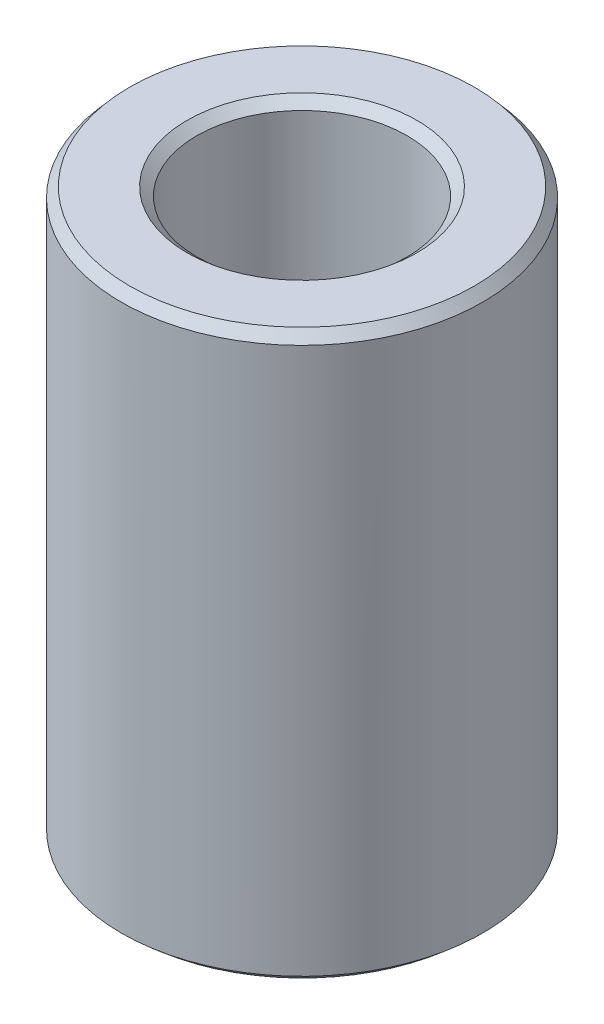
ISO-10303-21;
HEADER;
FILE_DESCRIPTION(('STEP AP214'),'2;1');
FILE_NAME('part.step','',(''),(''),'','','');
FILE_SCHEMA(('AUTOMOTIVE_DESIGN { 1 0 10303 214 1 1 1 1 }'));
ENDSEC;
DATA;
#1=APPLICATION_CONTEXT('core data for automotive mechanical design processes');
#2=APPLICATION_PROTOCOL_DEFINITION('international standard','automotive_design',2000,#1);
#3=PRODUCT_CONTEXT('',#1,'mechanical');
#4=PRODUCT('Part','Part','',(#3));
#5=PRODUCT_RELATED_PRODUCT_CATEGORY('part','',(#4));
#6=PRODUCT_DEFINITION_FORMATION('','',#4);
#7=PRODUCT_DEFINITION_CONTEXT('part definition',#1,'design');
#8=PRODUCT_DEFINITION('design','',#6,#7);
#9=PRODUCT_DEFINITION_SHAPE('','',#8);
#10=(LENGTH_UNIT() NAMED_UNIT(*) SI_UNIT(.MILLI.,.METRE.));
#11=(NAMED_UNIT(*) PLANE_ANGLE_UNIT() SI_UNIT($,.RADIAN.));
#12=(NAMED_UNIT(*) SI_UNIT($,.STERADIAN.) SOLID_ANGLE_UNIT());
#13=UNCERTAINTY_MEASURE_WITH_UNIT(LENGTH_MEASURE(1.E-05),#10,'distance_accuracy_value','');
#14=(GEOMETRIC_REPRESENTATION_CONTEXT(3) GLOBAL_UNCERTAINTY_ASSIGNED_CONTEXT((#13)) GLOBAL_UNIT_ASSIGNED_CONTEXT((#10,
#11,#12)) REPRESENTATION_CONTEXT('',''));
#15=CARTESIAN_POINT('',(0.,0.,0.));
#16=DIRECTION('',(0.,0.,1.));
#17=DIRECTION('',(1.,0.,0.));
#18=AXIS2_PLACEMENT_3D('',#15,#16,#17);
#19=CARTESIAN_POINT('',(0.,46.8625927404749,0.));
#20=DIRECTION('',(0.,-1.,0.));
#21=DIRECTION('',(0.,0.,-1.));
#22=AXIS2_PLACEMENT_3D('',#19,#20,#21);
#23=CYLINDRICAL_SURFACE('',#22,15.);
#24=CARTESIAN_POINT('',(0.,0.698088611148291,0.));
#25=DIRECTION('',(0.,1.,0.));
#26=DIRECTION('',(0.,0.,1.));
#27=AXIS2_PLACEMENT_3D('',#24,#25,#26);
#28=CIRCLE('',#27,15.);
#29=CARTESIAN_POINT('',(0.,0.698088611148284,-15.));
#30=VERTEX_POINT('',#29);
#31=EDGE_CURVE('E10',#30,#30,#28,.T.);
#32=CARTESIAN_POINT('',(0.,46.0512297365467,0.));
#33=DIRECTION('',(0.,1.,0.));
#34=DIRECTION('',(0.,0.,1.));
#35=AXIS2_PLACEMENT_3D('',#32,#33,#34);
#36=CIRCLE('',#35,15.);
#37=CARTESIAN_POINT('',(0.,46.0512297365467,-15.));
#38=VERTEX_POINT('',#37);
#39=EDGE_CURVE('E50',#38,#38,#36,.F.);
#40=CARTESIAN_POINT('',(0.,0.698088611148284,-15.));
#41=CARTESIAN_POINT('',(0.,1.17051716453785,-15.));
#42=CARTESIAN_POINT('',(0.,1.64294571792742,-15.));
#43=CARTESIAN_POINT('',(0.,2.58780282470655,-15.));
#44=CARTESIAN_POINT('',(0.,3.06023137809612,-15.));
#45=CARTESIAN_POINT('',(0.,4.00508848487525,-15.));
#46=CARTESIAN_POINT('',(0.,4.47751703826482,-15.));
#47=CARTESIAN_POINT('',(0.,5.42237414504395,-15.));
#48=CARTESIAN_POINT('',(0.,5.89480269843352,-15.));
#49=CARTESIAN_POINT('',(0.,6.83965980521265,-15.));
#50=CARTESIAN_POINT('',(0.,7.31208835860222,-15.));
#51=CARTESIAN_POINT('',(0.,8.25694546538135,-15.));
#52=CARTESIAN_POINT('',(0.,8.72937401877092,-15.));
#53=CARTESIAN_POINT('',(0.,9.67423112555005,-15.));
#54=CARTESIAN_POINT('',(0.,10.1466596789396,-15.));
#55=CARTESIAN_POINT('',(0.,11.0915167857187,-15.));
#56=CARTESIAN_POINT('',(0.,11.5639453391083,-15.));
#57=CARTESIAN_POINT('',(0.,12.5088024458875,-15.));
#58=CARTESIAN_POINT('',(0.,12.981230999277,-15.));
#59=CARTESIAN_POINT('',(0.,13.9260881060562,-15.));
#60=CARTESIAN_POINT('',(0.,14.3985166594457,-15.));
#61=CARTESIAN_POINT('',(0.,15.3433737662249,-15.));
#62=CARTESIAN_POINT('',(0.,15.8158023196144,-15.));
#63=CARTESIAN_POINT('',(0.,16.7606594263935,-15.));
#64=CARTESIAN_POINT('',(0.,17.2330879797831,-15.));
#65=CARTESIAN_POINT('',(0.,18.1779450865622,-15.));
#66=CARTESIAN_POINT('',(0.,18.6503736399518,-15.));
#67=CARTESIAN_POINT('',(0.,19.5952307467309,-15.));
#68=CARTESIAN_POINT('',(0.,20.0676593001205,-15.));
#69=CARTESIAN_POINT('',(0.,21.0125164068996,-15.));
#70=CARTESIAN_POINT('',(0.,21.4849449602892,-15.));
#71=CARTESIAN_POINT('',(0.,22.4298020670683,-15.));
#72=CARTESIAN_POINT('',(0.,22.9022306204579,-15.));
#73=CARTESIAN_POINT('',(0.,23.847087727237,-15.));
#74=CARTESIAN_POINT('',(0.,24.3195162806266,-15.));
#75=CARTESIAN_POINT('',(0.,25.2643733874058,-15.));
#76=CARTESIAN_POINT('',(0.,25.7368019407953,-15.));
#77=CARTESIAN_POINT('',(0.,26.6816590475744,-15.));
#78=CARTESIAN_POINT('',(0.,27.154087600964,-15.));
#79=CARTESIAN_POINT('',(0.,28.0989447077431,-15.));
#80=CARTESIAN_POINT('',(0.,28.5713732611327,-15.));
#81=CARTESIAN_POINT('',(0.,29.5162303679118,-15.));
#82=CARTESIAN_POINT('',(0.,29.9886589213014,-15.));
#83=CARTESIAN_POINT('',(0.,30.9335160280806,-15.));
#84=CARTESIAN_POINT('',(0.,31.4059445814701,-15.));
#85=CARTESIAN_POINT('',(0.,32.3508016882492,-15.));
#86=CARTESIAN_POINT('',(0.,32.8232302416388,-15.));
#87=CARTESIAN_POINT('',(0.,33.7680873484179,-15.));
#88=CARTESIAN_POINT('',(0.,34.2405159018075,-15.));
#89=CARTESIAN_POINT('',(0.,35.1853730085866,-15.));
#90=CARTESIAN_POINT('',(0.,35.6578015619762,-15.));
#91=CARTESIAN_POINT('',(0.,36.6026586687553,-15.));
#92=CARTESIAN_POINT('',(0.,37.0750872221449,-15.));
#93=CARTESIAN_POINT('',(0.,38.019944328924,-15.));
#94=CARTESIAN_POINT('',(0.,38.4923728823136,-15.));
#95=CARTESIAN_POINT('',(0.,39.4372299890927,-15.));
#96=CARTESIAN_POINT('',(0.,39.9096585424823,-15.));
#97=CARTESIAN_POINT('',(0.,40.8545156492614,-15.));
#98=CARTESIAN_POINT('',(0.,41.326944202651,-15.));
#99=CARTESIAN_POINT('',(0.,42.2718013094301,-15.));
#100=CARTESIAN_POINT('',(0.,42.7442298628197,-15.));
#101=CARTESIAN_POINT('',(0.,43.6890869695988,-15.));
#102=CARTESIAN_POINT('',(0.,44.1615155229884,-15.));
#103=CARTESIAN_POINT('',(0.,45.1063726297675,-15.));
#104=CARTESIAN_POINT('',(0.,45.5788011831571,-15.));
#105=CARTESIAN_POINT('',(0.,46.0512297365467,-15.));
#106=B_SPLINE_CURVE_WITH_KNOTS('',3,(#40,#41,#42,#43,#44,#45,#46,#47,#48,#49,#50,#51,#52,#53,
#54,#55,#56,#57,#58,#59,#60,#61,#62,#63,#64,#65,#66,#67,#68,#69,#70,#71,#72,#73,#74,#75,#76,#77,
#78,#79,#80,#81,#82,#83,#84,#85,#86,#87,#88,#89,#90,#91,#92,#93,#94,#95,#96,#97,#98,#99,#100,
#101,#102,#103,#104,#105),.UNSPECIFIED.,.F.,.F.,(4,2,2,2,2,2,2,2,2,2,2,2,2,2,2,2,2,2,2,2,2,2,2,
2,2,2,2,2,2,2,2,2,4),(0.,1.4172856601687,2.8345713203374,4.2518569805061,5.6691426406748,
7.0864283008435,8.5037139610122,9.9209996211809,11.3382852813496,12.7555709415183,
14.172856601687,15.5901422618557,17.0074279220244,18.4247135821931,19.8419992423618,
21.2592849025305,22.6765705626992,24.0938562228679,25.5111418830366,26.9284275432053,
28.345713203374,29.7629988635427,31.1802845237114,32.5975701838801,34.0148558440488,
35.4321415042175,36.8494271643862,38.2667128245549,39.6839984847236,41.1012841448923,
42.518569805061,43.9358554652297,45.3531411253984),.UNSPECIFIED.);
#107=EDGE_CURVE('BSEAM39',#30,#38,#106,.T.);
#108=ORIENTED_EDGE('',*,*,#31,.T.);
#109=ORIENTED_EDGE('',*,*,#39,.T.);
#110=ORIENTED_EDGE('',*,*,#107,.T.);
#111=ORIENTED_EDGE('',*,*,#107,.F.);
#112=EDGE_LOOP('',(#108,#110,#109,#111));
#113=FACE_BOUND('',#112,.T.);
#114=ADVANCED_FACE('F39',(#113),#23,.T.);
#115=CARTESIAN_POINT('',(0.,46.8625927404749,0.));
#116=DIRECTION('',(0.,1.,0.));
#117=DIRECTION('',(0.,0.,1.));
#118=AXIS2_PLACEMENT_3D('',#115,#116,#117);
#119=PLANE('',#118);
#120=CARTESIAN_POINT('',(0.,46.8625927404749,0.));
#121=DIRECTION('',(0.,1.,0.));
#122=DIRECTION('',(0.,0.,1.));
#123=AXIS2_PLACEMENT_3D('',#120,#121,#122);
#124=CIRCLE('',#123,9.53461942064555);
#125=CARTESIAN_POINT('',(0.,46.8625927404749,9.53461942064555));
#126=VERTEX_POINT('',#125);
#127=EDGE_CURVE('E58',#126,#126,#124,.F.);
#128=ORIENTED_EDGE('',*,*,#127,.T.);
#129=EDGE_LOOP('',(#128));
#130=FACE_BOUND('',#129,.T.);
#131=CARTESIAN_POINT('',(0.,46.8625927404749,0.));
#132=DIRECTION('',(0.,1.,0.));
#133=DIRECTION('',(0.,0.,1.));
#134=AXIS2_PLACEMENT_3D('',#131,#132,#133);
#135=CIRCLE('',#134,14.3019113888518);
#136=CARTESIAN_POINT('',(0.,46.8625927404749,14.3019113888518));
#137=VERTEX_POINT('',#136);
#138=EDGE_CURVE('E61',#137,#137,#135,.T.);
#139=ORIENTED_EDGE('',*,*,#138,.T.);
#140=EDGE_LOOP('',(#139));
#141=FACE_BOUND('',#140,.T.);
#142=ADVANCED_FACE('F88',(#130,#141),#119,.T.);
#143=CARTESIAN_POINT('',(0.,0.,0.));
#144=DIRECTION('',(0.,1.,0.));
#145=DIRECTION('',(0.,0.,1.));
#146=AXIS2_PLACEMENT_3D('',#143,#144,#145);
#147=PLANE('',#146);
#148=CARTESIAN_POINT('',(0.,0.,0.));
#149=DIRECTION('',(0.,1.,0.));
#150=DIRECTION('',(0.,0.,1.));
#151=AXIS2_PLACEMENT_3D('',#148,#149,#150);
#152=CIRCLE('',#151,9.4213450278655);
#153=CARTESIAN_POINT('',(0.,0.,9.4213450278655));
#154=VERTEX_POINT('',#153);
#155=EDGE_CURVE('E51',#154,#154,#152,.T.);
#156=ORIENTED_EDGE('',*,*,#155,.T.);
#157=EDGE_LOOP('',(#156));
#158=FACE_BOUND('',#157,.T.);
#159=CARTESIAN_POINT('',(0.,0.,0.));
#160=DIRECTION('',(0.,1.,0.));
#161=DIRECTION('',(0.,0.,1.));
#162=AXIS2_PLACEMENT_3D('',#159,#160,#161);
#163=CIRCLE('',#162,14.1886369960717);
#164=CARTESIAN_POINT('',(0.,0.,14.1886369960717));
#165=VERTEX_POINT('',#164);
#166=EDGE_CURVE('E54',#165,#165,#163,.F.);
#167=ORIENTED_EDGE('',*,*,#166,.T.);
#168=EDGE_LOOP('',(#167));
#169=FACE_BOUND('',#168,.T.);
#170=ADVANCED_FACE('F83',(#158,#169),#147,.F.);
#171=CARTESIAN_POINT('',(0.,46.8625927404749,0.));
#172=DIRECTION('',(0.,-1.,0.));
#173=DIRECTION('',(0.,0.,-1.));
#174=AXIS2_PLACEMENT_3D('',#171,#172,#173);
#175=CYLINDRICAL_SURFACE('',#174,8.72325641671726);
#176=CARTESIAN_POINT('',(0.,46.1645041293266,0.));
#177=DIRECTION('',(0.,1.,0.));
#178=DIRECTION('',(0.,0.,1.));
#179=AXIS2_PLACEMENT_3D('',#176,#177,#178);
#180=CIRCLE('',#179,8.72325641671726);
#181=CARTESIAN_POINT('',(0.,46.1645041293266,-8.72325641671726));
#182=VERTEX_POINT('',#181);
#183=EDGE_CURVE('E67',#182,#182,#180,.T.);
#184=CARTESIAN_POINT('',(0.,0.811363003928249,0.));
#185=DIRECTION('',(0.,1.,0.));
#186=DIRECTION('',(0.,0.,1.));
#187=AXIS2_PLACEMENT_3D('',#184,#185,#186);
#188=CIRCLE('',#187,8.72325641671726);
#189=CARTESIAN_POINT('',(0.,0.811363003928242,-8.72325641671726));
#190=VERTEX_POINT('',#189);
#191=EDGE_CURVE('E69',#190,#190,#188,.F.);
#192=CARTESIAN_POINT('',(0.,46.1645041293266,-8.72325641671726));
#193=CARTESIAN_POINT('',(0.,45.692075575937,-8.72325641671726));
#194=CARTESIAN_POINT('',(0.,45.2196470225475,-8.72325641671726));
#195=CARTESIAN_POINT('',(0.,44.2747899157683,-8.72325641671726));
#196=CARTESIAN_POINT('',(0.,43.8023613623788,-8.72325641671726));
#197=CARTESIAN_POINT('',(0.,42.8575042555996,-8.72325641671726));
#198=CARTESIAN_POINT('',(0.,42.3850757022101,-8.72325641671726));
#199=CARTESIAN_POINT('',(0.,41.4402185954309,-8.72325641671726));
#200=CARTESIAN_POINT('',(0.,40.9677900420414,-8.72325641671726));
#201=CARTESIAN_POINT('',(0.,40.0229329352622,-8.72325641671726));
#202=CARTESIAN_POINT('',(0.,39.5505043818727,-8.72325641671726));
#203=CARTESIAN_POINT('',(0.,38.6056472750935,-8.72325641671726));
#204=CARTESIAN_POINT('',(0.,38.133218721704,-8.72325641671726));
#205=CARTESIAN_POINT('',(0.,37.1883616149248,-8.72325641671726));
#206=CARTESIAN_POINT('',(0.,36.7159330615353,-8.72325641671726));
#207=CARTESIAN_POINT('',(0.,35.7710759547561,-8.72325641671726));
#208=CARTESIAN_POINT('',(0.,35.2986474013666,-8.72325641671726));
#209=CARTESIAN_POINT('',(0.,34.3537902945874,-8.72325641671726));
#210=CARTESIAN_POINT('',(0.,33.8813617411979,-8.72325641671726));
#211=CARTESIAN_POINT('',(0.,32.9365046344187,-8.72325641671726));
#212=CARTESIAN_POINT('',(0.,32.4640760810292,-8.72325641671726));
#213=CARTESIAN_POINT('',(0.,31.51921897425,-8.72325641671726));
#214=CARTESIAN_POINT('',(0.,31.0467904208605,-8.72325641671726));
#215=CARTESIAN_POINT('',(0.,30.1019333140813,-8.72325641671726));
#216=CARTESIAN_POINT('',(0.,29.6295047606918,-8.72325641671726));
#217=CARTESIAN_POINT('',(0.,28.6846476539126,-8.72325641671726));
#218=CARTESIAN_POINT('',(0.,28.2122191005231,-8.72325641671726));
#219=CARTESIAN_POINT('',(0.,27.2673619937439,-8.72325641671726));
#220=CARTESIAN_POINT('',(0.,26.7949334403544,-8.72325641671726));
#221=CARTESIAN_POINT('',(0.,25.8500763335752,-8.72325641671726));
#222=CARTESIAN_POINT('',(0.,25.3776477801857,-8.72325641671726));
#223=CARTESIAN_POINT('',(0.,24.4327906734066,-8.72325641671726));
#224=CARTESIAN_POINT('',(0.,23.960362120017,-8.72325641671726));
#225=CARTESIAN_POINT('',(0.,23.0155050132379,-8.72325641671726));
#226=CARTESIAN_POINT('',(0.,22.5430764598483,-8.72325641671726));
#227=CARTESIAN_POINT('',(0.,21.5982193530692,-8.72325641671726));
#228=CARTESIAN_POINT('',(0.,21.1257907996796,-8.72325641671726));
#229=CARTESIAN_POINT('',(0.,20.1809336929005,-8.72325641671726));
#230=CARTESIAN_POINT('',(0.,19.7085051395109,-8.72325641671726));
#231=CARTESIAN_POINT('',(0.,18.7636480327318,-8.72325641671726));
#232=CARTESIAN_POINT('',(0.,18.2912194793422,-8.72325641671726));
#233=CARTESIAN_POINT('',(0.,17.3463623725631,-8.72325641671726));
#234=CARTESIAN_POINT('',(0.,16.8739338191735,-8.72325641671726));
#235=CARTESIAN_POINT('',(0.,15.9290767123944,-8.72325641671726));
#236=CARTESIAN_POINT('',(0.,15.4566481590048,-8.72325641671726));
#237=CARTESIAN_POINT('',(0.,14.5117910522257,-8.72325641671726));
#238=CARTESIAN_POINT('',(0.,14.0393624988361,-8.72325641671726));
#239=CARTESIAN_POINT('',(0.,13.094505392057,-8.72325641671726));
#240=CARTESIAN_POINT('',(0.,12.6220768386674,-8.72325641671726));
#241=CARTESIAN_POINT('',(0.,11.6772197318883,-8.72325641671726));
#242=CARTESIAN_POINT('',(0.,11.2047911784987,-8.72325641671726));
#243=CARTESIAN_POINT('',(0.,10.2599340717196,-8.72325641671726));
#244=CARTESIAN_POINT('',(0.,9.78750551833,-8.72325641671726));
#245=CARTESIAN_POINT('',(0.,8.84264841155087,-8.72325641671726));
#246=CARTESIAN_POINT('',(0.,8.3702198581613,-8.72325641671726));
#247=CARTESIAN_POINT('',(0.,7.42536275138217,-8.72325641671726));
#248=CARTESIAN_POINT('',(0.,6.9529341979926,-8.72325641671726));
#249=CARTESIAN_POINT('',(0.,6.00807709121347,-8.72325641671726));
#250=CARTESIAN_POINT('',(0.,5.5356485378239,-8.72325641671726));
#251=CARTESIAN_POINT('',(0.,4.59079143104477,-8.72325641671726));
#252=CARTESIAN_POINT('',(0.,4.11836287765521,-8.72325641671726));
#253=CARTESIAN_POINT('',(0.,3.17350577087607,-8.72325641671726));
#254=CARTESIAN_POINT('',(0.,2.70107721748651,-8.72325641671726));
#255=CARTESIAN_POINT('',(0.,1.75622011070738,-8.72325641671726));
#256=CARTESIAN_POINT('',(0.,1.28379155731781,-8.72325641671726));
#257=CARTESIAN_POINT('',(0.,0.811363003928242,-8.72325641671726));
#258=B_SPLINE_CURVE_WITH_KNOTS('',3,(#192,#193,#194,#195,#196,#197,#198,#199,#200,#201,#202,
#203,#204,#205,#206,#207,#208,#209,#210,#211,#212,#213,#214,#215,#216,#217,#218,#219,#220,#221,
#222,#223,#224,#225,#226,#227,#228,#229,#230,#231,#232,#233,#234,#235,#236,#237,#238,#239,#240,
#241,#242,#243,#244,#245,#246,#247,#248,#249,#250,#251,#252,#253,#254,#255,#256,#257),
.UNSPECIFIED.,.F.,.F.,(4,2,2,2,2,2,2,2,2,2,2,2,2,2,2,2,2,2,2,2,2,2,2,2,2,2,2,2,2,2,2,2,4),(0.,
1.41728566016869,2.8345713203374,4.25185698050609,5.66914264067479,7.08642830084349,
8.50371396101219,9.92099962118088,11.3382852813496,12.7555709415183,14.172856601687,
15.5901422618557,17.0074279220244,18.4247135821931,19.8419992423618,21.2592849025305,
22.6765705626992,24.0938562228679,25.5111418830366,26.9284275432053,28.345713203374,
29.7629988635427,31.1802845237114,32.5975701838801,34.0148558440488,35.4321415042175,
36.8494271643862,38.2667128245549,39.6839984847236,41.1012841448923,42.518569805061,
43.9358554652297,45.3531411253984),.UNSPECIFIED.);
#259=EDGE_CURVE('BSEAM71',#182,#190,#258,.T.);
#260=ORIENTED_EDGE('',*,*,#183,.T.);
#261=ORIENTED_EDGE('',*,*,#191,.T.);
#262=ORIENTED_EDGE('',*,*,#259,.T.);
#263=ORIENTED_EDGE('',*,*,#259,.F.);
#264=EDGE_LOOP('',(#260,#262,#261,#263));
#265=FACE_BOUND('',#264,.T.);
#266=ADVANCED_FACE('F71',(#265),#175,.F.);
#267=CARTESIAN_POINT('',(0.,46.1645041293266,0.));
#268=DIRECTION('',(0.,1.,0.));
#269=DIRECTION('',(0.,0.,1.));
#270=AXIS2_PLACEMENT_3D('',#267,#268,#269);
#271=CONICAL_SURFACE('',#270,8.72325641671726,0.860301175751531);
#272=ORIENTED_EDGE('',*,*,#127,.F.);
#273=EDGE_LOOP('',(#272));
#274=FACE_BOUND('',#273,.T.);
#275=ORIENTED_EDGE('',*,*,#183,.F.);
#276=EDGE_LOOP('',(#275));
#277=FACE_BOUND('',#276,.T.);
#278=ADVANCED_FACE('F77',(#274,#277),#271,.F.);
#279=CARTESIAN_POINT('',(0.,0.,0.));
#280=DIRECTION('',(0.,-1.,0.));
#281=DIRECTION('',(0.,0.,-1.));
#282=AXIS2_PLACEMENT_3D('',#279,#280,#281);
#283=CONICAL_SURFACE('',#282,9.4213450278655,0.710495151043363);
#284=ORIENTED_EDGE('',*,*,#191,.F.);
#285=EDGE_LOOP('',(#284));
#286=FACE_BOUND('',#285,.T.);
#287=ORIENTED_EDGE('',*,*,#155,.F.);
#288=EDGE_LOOP('',(#287));
#289=FACE_BOUND('',#288,.T.);
#290=ADVANCED_FACE('F73',(#286,#289),#283,.F.);
#291=CARTESIAN_POINT('',(0.,0.698088611148291,0.));
#292=DIRECTION('',(0.,1.,0.));
#293=DIRECTION('',(0.,0.,1.));
#294=AXIS2_PLACEMENT_3D('',#291,#292,#293);
#295=CONICAL_SURFACE('',#294,15.,0.86030117575153);
#296=ORIENTED_EDGE('',*,*,#166,.F.);
#297=EDGE_LOOP('',(#296));
#298=FACE_BOUND('',#297,.T.);
#299=ORIENTED_EDGE('',*,*,#31,.F.);
#300=EDGE_LOOP('',(#299));
#301=FACE_BOUND('',#300,.T.);
#302=ADVANCED_FACE('F76',(#298,#301),#295,.T.);
#303=CARTESIAN_POINT('',(0.,46.8625927404749,0.));
#304=DIRECTION('',(0.,-1.,0.));
#305=DIRECTION('',(0.,0.,-1.));
#306=AXIS2_PLACEMENT_3D('',#303,#304,#305);
#307=CONICAL_SURFACE('',#306,14.3019113888518,0.710495151043369);
#308=ORIENTED_EDGE('',*,*,#39,.F.);
#309=EDGE_LOOP('',(#308));
#310=FACE_BOUND('',#309,.T.);
#311=ORIENTED_EDGE('',*,*,#138,.F.);
#312=EDGE_LOOP('',(#311));
#313=FACE_BOUND('',#312,.T.);
#314=ADVANCED_FACE('F45',(#310,#313),#307,.T.);
#315=CLOSED_SHELL('',(#114,#142,#170,#266,#278,#290,#302,#314));
#316=MANIFOLD_SOLID_BREP('B2',#315);
#317=ADVANCED_BREP_SHAPE_REPRESENTATION('',(#18,#316),#14);
#318=SHAPE_DEFINITION_REPRESENTATION(#9,#317);
ENDSEC;
END-ISO-10303-21;
